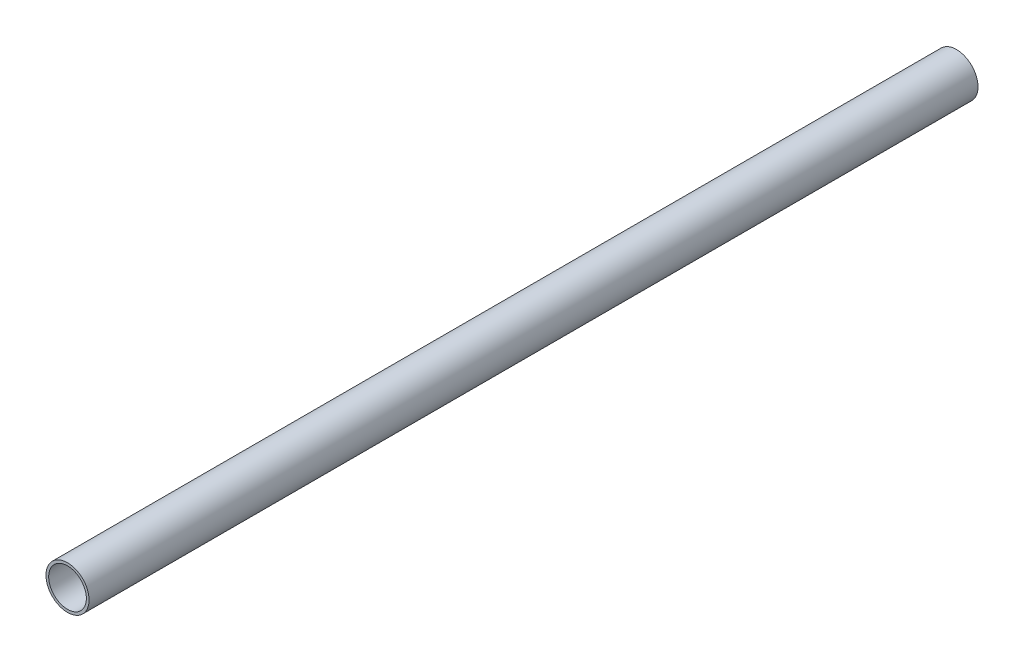
ISO-10303-21;
HEADER;
FILE_DESCRIPTION(('STEP AP214'),'2;1');
FILE_NAME('part.step','',(''),(''),'','','');
FILE_SCHEMA(('AUTOMOTIVE_DESIGN { 1 0 10303 214 1 1 1 1 }'));
ENDSEC;
DATA;
#1=APPLICATION_CONTEXT('core data for automotive mechanical design processes');
#2=APPLICATION_PROTOCOL_DEFINITION('international standard','automotive_design',2000,#1);
#3=PRODUCT_CONTEXT('',#1,'mechanical');
#4=PRODUCT('Part','Part','',(#3));
#5=PRODUCT_RELATED_PRODUCT_CATEGORY('part','',(#4));
#6=PRODUCT_DEFINITION_FORMATION('','',#4);
#7=PRODUCT_DEFINITION_CONTEXT('part definition',#1,'design');
#8=PRODUCT_DEFINITION('design','',#6,#7);
#9=PRODUCT_DEFINITION_SHAPE('','',#8);
#10=(LENGTH_UNIT() NAMED_UNIT(*) SI_UNIT(.MILLI.,.METRE.));
#11=(NAMED_UNIT(*) PLANE_ANGLE_UNIT() SI_UNIT($,.RADIAN.));
#12=(NAMED_UNIT(*) SI_UNIT($,.STERADIAN.) SOLID_ANGLE_UNIT());
#13=UNCERTAINTY_MEASURE_WITH_UNIT(LENGTH_MEASURE(1.E-05),#10,'distance_accuracy_value','');
#14=(GEOMETRIC_REPRESENTATION_CONTEXT(3) GLOBAL_UNCERTAINTY_ASSIGNED_CONTEXT((#13)) GLOBAL_UNIT_ASSIGNED_CONTEXT((#10,
#11,#12)) REPRESENTATION_CONTEXT('',''));
#15=CARTESIAN_POINT('',(0.,0.,0.));
#16=DIRECTION('',(0.,0.,1.));
#17=DIRECTION('',(1.,0.,0.));
#18=AXIS2_PLACEMENT_3D('',#15,#16,#17);
#19=CARTESIAN_POINT('',(0.,0.,-165.));
#20=DIRECTION('',(0.,0.,1.));
#21=DIRECTION('',(1.,0.,0.));
#22=AXIS2_PLACEMENT_3D('',#19,#20,#21);
#23=CYLINDRICAL_SURFACE('',#22,8.);
#24=CARTESIAN_POINT('',(0.,0.,-165.));
#25=DIRECTION('',(0.,0.,1.));
#26=DIRECTION('',(1.,0.,0.));
#27=AXIS2_PLACEMENT_3D('',#24,#25,#26);
#28=CIRCLE('',#27,8.);
#29=CARTESIAN_POINT('',(8.,0.,-165.));
#30=VERTEX_POINT('',#29);
#31=EDGE_CURVE('E11',#30,#30,#28,.T.);
#32=ORIENTED_EDGE('',*,*,#31,.T.);
#33=EDGE_LOOP('',(#32));
#34=FACE_BOUND('',#33,.T.);
#35=CARTESIAN_POINT('',(0.,0.,165.));
#36=DIRECTION('',(0.,0.,1.));
#37=DIRECTION('',(1.,0.,0.));
#38=AXIS2_PLACEMENT_3D('',#35,#36,#37);
#39=CIRCLE('',#38,8.);
#40=CARTESIAN_POINT('',(8.,0.,165.));
#41=VERTEX_POINT('',#40);
#42=EDGE_CURVE('E54',#41,#41,#39,.T.);
#43=ORIENTED_EDGE('',*,*,#42,.F.);
#44=EDGE_LOOP('',(#43));
#45=FACE_BOUND('',#44,.T.);
#46=ADVANCED_FACE('F44',(#34,#45),#23,.T.);
#47=CARTESIAN_POINT('',(0.,0.,-165.));
#48=DIRECTION('',(0.,0.,1.));
#49=DIRECTION('',(1.,0.,0.));
#50=AXIS2_PLACEMENT_3D('',#47,#48,#49);
#51=PLANE('',#50);
#52=CARTESIAN_POINT('',(0.,0.,-165.));
#53=DIRECTION('',(0.,0.,1.));
#54=DIRECTION('',(1.,0.,0.));
#55=AXIS2_PLACEMENT_3D('',#52,#53,#54);
#56=CIRCLE('',#55,7.);
#57=CARTESIAN_POINT('',(7.,0.,-165.));
#58=VERTEX_POINT('',#57);
#59=EDGE_CURVE('E50',#58,#58,#56,.T.);
#60=ORIENTED_EDGE('',*,*,#59,.T.);
#61=EDGE_LOOP('',(#60));
#62=FACE_BOUND('',#61,.T.);
#63=ORIENTED_EDGE('',*,*,#31,.F.);
#64=EDGE_LOOP('',(#63));
#65=FACE_BOUND('',#64,.T.);
#66=ADVANCED_FACE('F73',(#62,#65),#51,.F.);
#67=CARTESIAN_POINT('',(0.,0.,-165.));
#68=DIRECTION('',(0.,0.,1.));
#69=DIRECTION('',(1.,0.,0.));
#70=AXIS2_PLACEMENT_3D('',#67,#68,#69);
#71=CYLINDRICAL_SURFACE('',#70,7.);
#72=ORIENTED_EDGE('',*,*,#59,.F.);
#73=EDGE_LOOP('',(#72));
#74=FACE_BOUND('',#73,.T.);
#75=CARTESIAN_POINT('',(0.,0.,165.));
#76=DIRECTION('',(0.,0.,1.));
#77=DIRECTION('',(1.,0.,0.));
#78=AXIS2_PLACEMENT_3D('',#75,#76,#77);
#79=CIRCLE('',#78,7.);
#80=CARTESIAN_POINT('',(7.,0.,165.));
#81=VERTEX_POINT('',#80);
#82=EDGE_CURVE('E58',#81,#81,#79,.T.);
#83=ORIENTED_EDGE('',*,*,#82,.T.);
#84=EDGE_LOOP('',(#83));
#85=FACE_BOUND('',#84,.T.);
#86=ADVANCED_FACE('F64',(#74,#85),#71,.F.);
#87=CARTESIAN_POINT('',(0.,0.,165.));
#88=DIRECTION('',(0.,0.,1.));
#89=DIRECTION('',(1.,0.,0.));
#90=AXIS2_PLACEMENT_3D('',#87,#88,#89);
#91=PLANE('',#90);
#92=ORIENTED_EDGE('',*,*,#42,.T.);
#93=EDGE_LOOP('',(#92));
#94=FACE_BOUND('',#93,.T.);
#95=ORIENTED_EDGE('',*,*,#82,.F.);
#96=EDGE_LOOP('',(#95));
#97=FACE_BOUND('',#96,.T.);
#98=ADVANCED_FACE('F66',(#94,#97),#91,.T.);
#99=CLOSED_SHELL('',(#46,#66,#86,#98));
#100=MANIFOLD_SOLID_BREP('B2',#99);
#101=ADVANCED_BREP_SHAPE_REPRESENTATION('',(#18,#100),#14);
#102=SHAPE_DEFINITION_REPRESENTATION(#9,#101);
ENDSEC;
END-ISO-10303-21;
